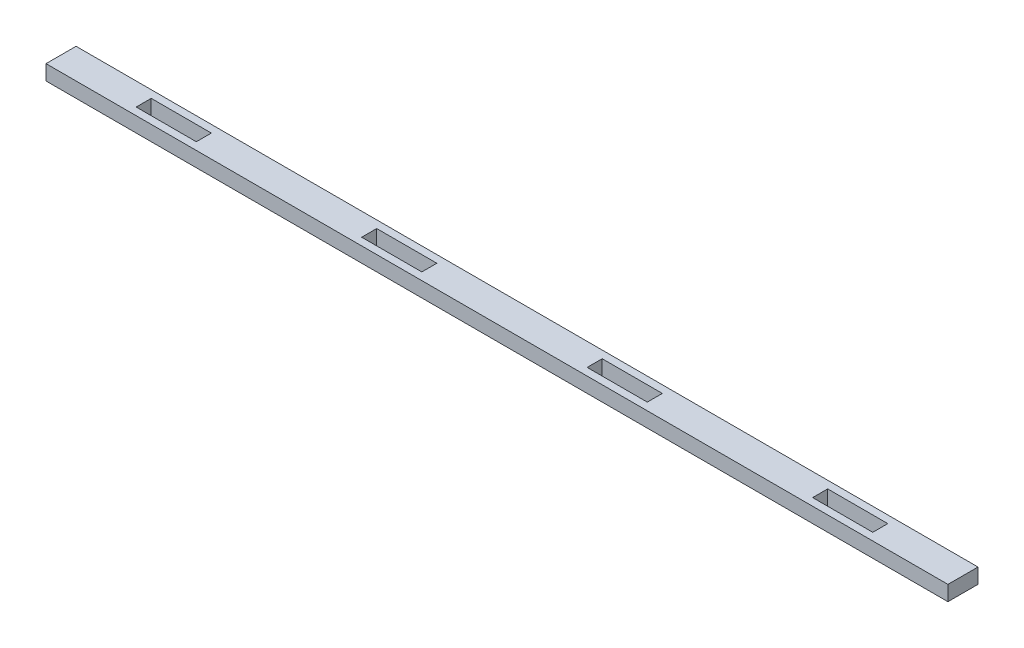
ISO-10303-21;
HEADER;
FILE_DESCRIPTION(('STEP AP214'),'2;1');
FILE_NAME('part.step','',(''),(''),'','','');
FILE_SCHEMA(('AUTOMOTIVE_DESIGN { 1 0 10303 214 1 1 1 1 }'));
ENDSEC;
DATA;
#1=APPLICATION_CONTEXT('core data for automotive mechanical design processes');
#2=APPLICATION_PROTOCOL_DEFINITION('international standard','automotive_design',2000,#1);
#3=PRODUCT_CONTEXT('',#1,'mechanical');
#4=PRODUCT('Part','Part','',(#3));
#5=PRODUCT_RELATED_PRODUCT_CATEGORY('part','',(#4));
#6=PRODUCT_DEFINITION_FORMATION('','',#4);
#7=PRODUCT_DEFINITION_CONTEXT('part definition',#1,'design');
#8=PRODUCT_DEFINITION('design','',#6,#7);
#9=PRODUCT_DEFINITION_SHAPE('','',#8);
#10=(LENGTH_UNIT() NAMED_UNIT(*) SI_UNIT(.MILLI.,.METRE.));
#11=(NAMED_UNIT(*) PLANE_ANGLE_UNIT() SI_UNIT($,.RADIAN.));
#12=(NAMED_UNIT(*) SI_UNIT($,.STERADIAN.) SOLID_ANGLE_UNIT());
#13=UNCERTAINTY_MEASURE_WITH_UNIT(LENGTH_MEASURE(1.E-05),#10,'distance_accuracy_value','');
#14=(GEOMETRIC_REPRESENTATION_CONTEXT(3) GLOBAL_UNCERTAINTY_ASSIGNED_CONTEXT((#13)) GLOBAL_UNIT_ASSIGNED_CONTEXT((#10,
#11,#12)) REPRESENTATION_CONTEXT('',''));
#15=CARTESIAN_POINT('',(0.,0.,0.));
#16=DIRECTION('',(0.,0.,1.));
#17=DIRECTION('',(1.,0.,0.));
#18=AXIS2_PLACEMENT_3D('',#15,#16,#17);
#19=CARTESIAN_POINT('',(130.175,0.,-3.17500000000001));
#20=DIRECTION('',(0.,0.,-1.));
#21=DIRECTION('',(-1.,0.,0.));
#22=AXIS2_PLACEMENT_3D('',#19,#20,#21);
#23=PLANE('',#22);
#24=DIRECTION('',(-1.,0.,0.));
#25=VECTOR('',#24,1.);
#26=CARTESIAN_POINT('',(130.175,6.35,-3.17500000000001));
#27=LINE('',#26,#25);
#28=CARTESIAN_POINT('',(155.575,6.35,-3.17499999999999));
#29=VERTEX_POINT('',#28);
#30=CARTESIAN_POINT('',(130.175,6.35,-3.17500000000001));
#31=VERTEX_POINT('',#30);
#32=EDGE_CURVE('E316',#29,#31,#27,.T.);
#33=ORIENTED_EDGE('',*,*,#32,.T.);
#34=DIRECTION('',(0.,1.,0.));
#35=VECTOR('',#34,1.);
#36=CARTESIAN_POINT('',(130.175,0.,-3.17500000000001));
#37=LINE('',#36,#35);
#38=CARTESIAN_POINT('',(130.175,0.,-3.17500000000001));
#39=VERTEX_POINT('',#38);
#40=EDGE_CURVE('E11',#39,#31,#37,.T.);
#41=ORIENTED_EDGE('',*,*,#40,.F.);
#42=DIRECTION('',(-1.,0.,0.));
#43=VECTOR('',#42,1.);
#44=CARTESIAN_POINT('',(130.175,0.,-3.17500000000001));
#45=LINE('',#44,#43);
#46=CARTESIAN_POINT('',(155.575,0.,-3.17499999999999));
#47=VERTEX_POINT('',#46);
#48=EDGE_CURVE('E320',#47,#39,#45,.T.);
#49=ORIENTED_EDGE('',*,*,#48,.F.);
#50=DIRECTION('',(0.,1.,0.));
#51=VECTOR('',#50,1.);
#52=CARTESIAN_POINT('',(155.575,0.,-3.17499999999999));
#53=LINE('',#52,#51);
#54=EDGE_CURVE('E325',#47,#29,#53,.T.);
#55=ORIENTED_EDGE('',*,*,#54,.T.);
#56=EDGE_LOOP('',(#33,#41,#49,#55));
#57=FACE_BOUND('',#56,.T.);
#58=ADVANCED_FACE('F35',(#57),#23,.F.);
#59=CARTESIAN_POINT('',(130.175,0.,-3.17500000000001));
#60=DIRECTION('',(-1.,0.,0.));
#61=DIRECTION('',(0.,0.,1.));
#62=AXIS2_PLACEMENT_3D('',#59,#60,#61);
#63=PLANE('',#62);
#64=DIRECTION('',(0.,0.,1.));
#65=VECTOR('',#64,1.);
#66=CARTESIAN_POINT('',(130.175,6.35,-3.17500000000001));
#67=LINE('',#66,#65);
#68=CARTESIAN_POINT('',(130.175,6.35,3.17500000000001));
#69=VERTEX_POINT('',#68);
#70=EDGE_CURVE('E313',#31,#69,#67,.T.);
#71=ORIENTED_EDGE('',*,*,#70,.T.);
#72=DIRECTION('',(0.,1.,0.));
#73=VECTOR('',#72,1.);
#74=CARTESIAN_POINT('',(130.175,0.,3.17500000000001));
#75=LINE('',#74,#73);
#76=CARTESIAN_POINT('',(130.175,0.,3.17500000000001));
#77=VERTEX_POINT('',#76);
#78=EDGE_CURVE('E42',#77,#69,#75,.T.);
#79=ORIENTED_EDGE('',*,*,#78,.F.);
#80=DIRECTION('',(0.,0.,1.));
#81=VECTOR('',#80,1.);
#82=CARTESIAN_POINT('',(130.175,0.,-3.17500000000001));
#83=LINE('',#82,#81);
#84=EDGE_CURVE('E56',#39,#77,#83,.T.);
#85=ORIENTED_EDGE('',*,*,#84,.F.);
#86=ORIENTED_EDGE('',*,*,#40,.T.);
#87=EDGE_LOOP('',(#71,#79,#85,#86));
#88=FACE_BOUND('',#87,.T.);
#89=ADVANCED_FACE('F335',(#88),#63,.F.);
#90=CARTESIAN_POINT('',(130.175,0.,3.17500000000001));
#91=DIRECTION('',(0.,0.,1.));
#92=DIRECTION('',(1.,0.,0.));
#93=AXIS2_PLACEMENT_3D('',#90,#91,#92);
#94=PLANE('',#93);
#95=DIRECTION('',(1.,0.,0.));
#96=VECTOR('',#95,1.);
#97=CARTESIAN_POINT('',(130.175,6.35,3.17500000000001));
#98=LINE('',#97,#96);
#99=CARTESIAN_POINT('',(155.575,6.35,3.17500000000001));
#100=VERTEX_POINT('',#99);
#101=EDGE_CURVE('E310',#69,#100,#98,.T.);
#102=ORIENTED_EDGE('',*,*,#101,.T.);
#103=DIRECTION('',(0.,1.,0.));
#104=VECTOR('',#103,1.);
#105=CARTESIAN_POINT('',(155.575,0.,3.17500000000001));
#106=LINE('',#105,#104);
#107=CARTESIAN_POINT('',(155.575,0.,3.17500000000001));
#108=VERTEX_POINT('',#107);
#109=EDGE_CURVE('E328',#108,#100,#106,.T.);
#110=ORIENTED_EDGE('',*,*,#109,.F.);
#111=DIRECTION('',(1.,0.,0.));
#112=VECTOR('',#111,1.);
#113=CARTESIAN_POINT('',(130.175,0.,3.17500000000001));
#114=LINE('',#113,#112);
#115=EDGE_CURVE('E323',#77,#108,#114,.T.);
#116=ORIENTED_EDGE('',*,*,#115,.F.);
#117=ORIENTED_EDGE('',*,*,#78,.T.);
#118=EDGE_LOOP('',(#102,#110,#116,#117));
#119=FACE_BOUND('',#118,.T.);
#120=ADVANCED_FACE('F332',(#119),#94,.F.);
#121=CARTESIAN_POINT('',(155.575,0.,-3.17499999999999));
#122=DIRECTION('',(1.,0.,0.));
#123=DIRECTION('',(0.,0.,-1.));
#124=AXIS2_PLACEMENT_3D('',#121,#122,#123);
#125=PLANE('',#124);
#126=DIRECTION('',(0.,0.,-1.));
#127=VECTOR('',#126,1.);
#128=CARTESIAN_POINT('',(155.575,6.35,-3.17499999999999));
#129=LINE('',#128,#127);
#130=EDGE_CURVE('E308',#100,#29,#129,.T.);
#131=ORIENTED_EDGE('',*,*,#130,.T.);
#132=ORIENTED_EDGE('',*,*,#54,.F.);
#133=DIRECTION('',(0.,0.,-1.));
#134=VECTOR('',#133,1.);
#135=CARTESIAN_POINT('',(155.575,0.,-3.17499999999999));
#136=LINE('',#135,#134);
#137=EDGE_CURVE('E49',#108,#47,#136,.T.);
#138=ORIENTED_EDGE('',*,*,#137,.F.);
#139=ORIENTED_EDGE('',*,*,#109,.T.);
#140=EDGE_LOOP('',(#131,#132,#138,#139));
#141=FACE_BOUND('',#140,.T.);
#142=ADVANCED_FACE('F341',(#141),#125,.F.);
#143=CARTESIAN_POINT('',(34.9250000000001,0.,-3.17500000000001));
#144=DIRECTION('',(0.,0.,-1.));
#145=DIRECTION('',(-1.,0.,0.));
#146=AXIS2_PLACEMENT_3D('',#143,#144,#145);
#147=PLANE('',#146);
#148=DIRECTION('',(-1.,0.,0.));
#149=VECTOR('',#148,1.);
#150=CARTESIAN_POINT('',(34.9250000000001,6.35,-3.17500000000001));
#151=LINE('',#150,#149);
#152=CARTESIAN_POINT('',(60.3250000000001,6.35,-3.17499999999999));
#153=VERTEX_POINT('',#152);
#154=CARTESIAN_POINT('',(34.9250000000001,6.35,-3.17500000000001));
#155=VERTEX_POINT('',#154);
#156=EDGE_CURVE('E284',#153,#155,#151,.T.);
#157=ORIENTED_EDGE('',*,*,#156,.T.);
#158=DIRECTION('',(0.,1.,0.));
#159=VECTOR('',#158,1.);
#160=CARTESIAN_POINT('',(34.9250000000001,0.,-3.17500000000001));
#161=LINE('',#160,#159);
#162=CARTESIAN_POINT('',(34.9250000000001,0.,-3.17500000000001));
#163=VERTEX_POINT('',#162);
#164=EDGE_CURVE('E305',#163,#155,#161,.T.);
#165=ORIENTED_EDGE('',*,*,#164,.F.);
#166=DIRECTION('',(-1.,0.,0.));
#167=VECTOR('',#166,1.);
#168=CARTESIAN_POINT('',(34.9250000000001,0.,-3.17500000000001));
#169=LINE('',#168,#167);
#170=CARTESIAN_POINT('',(60.3250000000001,0.,-3.17499999999999));
#171=VERTEX_POINT('',#170);
#172=EDGE_CURVE('E289',#171,#163,#169,.T.);
#173=ORIENTED_EDGE('',*,*,#172,.F.);
#174=DIRECTION('',(0.,1.,0.));
#175=VECTOR('',#174,1.);
#176=CARTESIAN_POINT('',(60.3250000000001,0.,-3.17499999999999));
#177=LINE('',#176,#175);
#178=EDGE_CURVE('E296',#171,#153,#177,.T.);
#179=ORIENTED_EDGE('',*,*,#178,.T.);
#180=EDGE_LOOP('',(#157,#165,#173,#179));
#181=FACE_BOUND('',#180,.T.);
#182=ADVANCED_FACE('F343',(#181),#147,.F.);
#183=CARTESIAN_POINT('',(34.9250000000001,0.,-3.17500000000001));
#184=DIRECTION('',(-1.,0.,0.));
#185=DIRECTION('',(0.,0.,1.));
#186=AXIS2_PLACEMENT_3D('',#183,#184,#185);
#187=PLANE('',#186);
#188=DIRECTION('',(0.,0.,1.));
#189=VECTOR('',#188,1.);
#190=CARTESIAN_POINT('',(34.9250000000001,6.35,-3.17500000000001));
#191=LINE('',#190,#189);
#192=CARTESIAN_POINT('',(34.9250000000001,6.35,3.17500000000001));
#193=VERTEX_POINT('',#192);
#194=EDGE_CURVE('E281',#155,#193,#191,.T.);
#195=ORIENTED_EDGE('',*,*,#194,.T.);
#196=DIRECTION('',(0.,1.,0.));
#197=VECTOR('',#196,1.);
#198=CARTESIAN_POINT('',(34.9250000000001,0.,3.17500000000001));
#199=LINE('',#198,#197);
#200=CARTESIAN_POINT('',(34.9250000000001,0.,3.17500000000001));
#201=VERTEX_POINT('',#200);
#202=EDGE_CURVE('E302',#201,#193,#199,.T.);
#203=ORIENTED_EDGE('',*,*,#202,.F.);
#204=DIRECTION('',(0.,0.,1.));
#205=VECTOR('',#204,1.);
#206=CARTESIAN_POINT('',(34.9250000000001,0.,-3.17500000000001));
#207=LINE('',#206,#205);
#208=EDGE_CURVE('E291',#163,#201,#207,.T.);
#209=ORIENTED_EDGE('',*,*,#208,.F.);
#210=ORIENTED_EDGE('',*,*,#164,.T.);
#211=EDGE_LOOP('',(#195,#203,#209,#210));
#212=FACE_BOUND('',#211,.T.);
#213=ADVANCED_FACE('F349',(#212),#187,.F.);
#214=CARTESIAN_POINT('',(34.9250000000001,0.,3.17500000000001));
#215=DIRECTION('',(0.,0.,1.));
#216=DIRECTION('',(1.,0.,0.));
#217=AXIS2_PLACEMENT_3D('',#214,#215,#216);
#218=PLANE('',#217);
#219=DIRECTION('',(1.,0.,0.));
#220=VECTOR('',#219,1.);
#221=CARTESIAN_POINT('',(34.9250000000001,6.35,3.17500000000001));
#222=LINE('',#221,#220);
#223=CARTESIAN_POINT('',(60.3250000000001,6.35,3.17500000000001));
#224=VERTEX_POINT('',#223);
#225=EDGE_CURVE('E278',#193,#224,#222,.T.);
#226=ORIENTED_EDGE('',*,*,#225,.T.);
#227=DIRECTION('',(0.,1.,0.));
#228=VECTOR('',#227,1.);
#229=CARTESIAN_POINT('',(60.3250000000001,0.,3.17500000000001));
#230=LINE('',#229,#228);
#231=CARTESIAN_POINT('',(60.3250000000001,0.,3.17500000000001));
#232=VERTEX_POINT('',#231);
#233=EDGE_CURVE('E299',#232,#224,#230,.T.);
#234=ORIENTED_EDGE('',*,*,#233,.F.);
#235=DIRECTION('',(1.,0.,0.));
#236=VECTOR('',#235,1.);
#237=CARTESIAN_POINT('',(34.9250000000001,0.,3.17500000000001));
#238=LINE('',#237,#236);
#239=EDGE_CURVE('E293',#201,#232,#238,.T.);
#240=ORIENTED_EDGE('',*,*,#239,.F.);
#241=ORIENTED_EDGE('',*,*,#202,.T.);
#242=EDGE_LOOP('',(#226,#234,#240,#241));
#243=FACE_BOUND('',#242,.T.);
#244=ADVANCED_FACE('F382',(#243),#218,.F.);
#245=CARTESIAN_POINT('',(60.3250000000001,0.,-3.17499999999999));
#246=DIRECTION('',(1.,0.,0.));
#247=DIRECTION('',(0.,0.,-1.));
#248=AXIS2_PLACEMENT_3D('',#245,#246,#247);
#249=PLANE('',#248);
#250=DIRECTION('',(0.,0.,-1.));
#251=VECTOR('',#250,1.);
#252=CARTESIAN_POINT('',(60.3250000000001,6.35,-3.17499999999999));
#253=LINE('',#252,#251);
#254=EDGE_CURVE('E276',#224,#153,#253,.T.);
#255=ORIENTED_EDGE('',*,*,#254,.T.);
#256=ORIENTED_EDGE('',*,*,#178,.F.);
#257=DIRECTION('',(0.,0.,-1.));
#258=VECTOR('',#257,1.);
#259=CARTESIAN_POINT('',(60.3250000000001,0.,-3.17499999999999));
#260=LINE('',#259,#258);
#261=EDGE_CURVE('E287',#232,#171,#260,.T.);
#262=ORIENTED_EDGE('',*,*,#261,.F.);
#263=ORIENTED_EDGE('',*,*,#233,.T.);
#264=EDGE_LOOP('',(#255,#256,#262,#263));
#265=FACE_BOUND('',#264,.T.);
#266=ADVANCED_FACE('F392',(#265),#249,.F.);
#267=CARTESIAN_POINT('',(190.5,6.35,-6.35));
#268=DIRECTION('',(-1.,0.,0.));
#269=DIRECTION('',(0.,0.,1.));
#270=AXIS2_PLACEMENT_3D('',#267,#268,#269);
#271=PLANE('',#270);
#272=DIRECTION('',(0.,0.,-1.));
#273=VECTOR('',#272,1.);
#274=CARTESIAN_POINT('',(190.5,0.,-6.35));
#275=LINE('',#274,#273);
#276=CARTESIAN_POINT('',(190.5,0.,6.35));
#277=VERTEX_POINT('',#276);
#278=CARTESIAN_POINT('',(190.5,0.,-6.35));
#279=VERTEX_POINT('',#278);
#280=EDGE_CURVE('E240',#277,#279,#275,.T.);
#281=ORIENTED_EDGE('',*,*,#280,.T.);
#282=DIRECTION('',(0.,-1.,0.));
#283=VECTOR('',#282,1.);
#284=CARTESIAN_POINT('',(190.5,6.35,-6.35));
#285=LINE('',#284,#283);
#286=CARTESIAN_POINT('',(190.5,6.35,-6.35));
#287=VERTEX_POINT('',#286);
#288=EDGE_CURVE('E273',#287,#279,#285,.T.);
#289=ORIENTED_EDGE('',*,*,#288,.F.);
#290=DIRECTION('',(0.,0.,-1.));
#291=VECTOR('',#290,1.);
#292=CARTESIAN_POINT('',(190.5,6.35,-6.35));
#293=LINE('',#292,#291);
#294=CARTESIAN_POINT('',(190.5,6.35,6.35));
#295=VERTEX_POINT('',#294);
#296=EDGE_CURVE('E247',#295,#287,#293,.T.);
#297=ORIENTED_EDGE('',*,*,#296,.F.);
#298=DIRECTION('',(0.,-1.,0.));
#299=VECTOR('',#298,1.);
#300=CARTESIAN_POINT('',(190.5,6.35,6.35));
#301=LINE('',#300,#299);
#302=EDGE_CURVE('E257',#295,#277,#301,.T.);
#303=ORIENTED_EDGE('',*,*,#302,.T.);
#304=EDGE_LOOP('',(#281,#289,#297,#303));
#305=FACE_BOUND('',#304,.T.);
#306=ADVANCED_FACE('F402',(#305),#271,.F.);
#307=CARTESIAN_POINT('',(-190.5,6.35,-6.35));
#308=DIRECTION('',(0.,0.,1.));
#309=DIRECTION('',(1.,0.,0.));
#310=AXIS2_PLACEMENT_3D('',#307,#308,#309);
#311=PLANE('',#310);
#312=DIRECTION('',(-1.,0.,0.));
#313=VECTOR('',#312,1.);
#314=CARTESIAN_POINT('',(-190.5,0.,-6.35));
#315=LINE('',#314,#313);
#316=CARTESIAN_POINT('',(-190.5,0.,-6.35));
#317=VERTEX_POINT('',#316);
#318=EDGE_CURVE('E260',#279,#317,#315,.T.);
#319=ORIENTED_EDGE('',*,*,#318,.T.);
#320=DIRECTION('',(0.,-1.,0.));
#321=VECTOR('',#320,1.);
#322=CARTESIAN_POINT('',(-190.5,6.35,-6.35));
#323=LINE('',#322,#321);
#324=CARTESIAN_POINT('',(-190.5,6.35,-6.35));
#325=VERTEX_POINT('',#324);
#326=EDGE_CURVE('E270',#325,#317,#323,.T.);
#327=ORIENTED_EDGE('',*,*,#326,.F.);
#328=DIRECTION('',(-1.,0.,0.));
#329=VECTOR('',#328,1.);
#330=CARTESIAN_POINT('',(-190.5,6.35,-6.35));
#331=LINE('',#330,#329);
#332=EDGE_CURVE('E250',#287,#325,#331,.T.);
#333=ORIENTED_EDGE('',*,*,#332,.F.);
#334=ORIENTED_EDGE('',*,*,#288,.T.);
#335=EDGE_LOOP('',(#319,#327,#333,#334));
#336=FACE_BOUND('',#335,.T.);
#337=ADVANCED_FACE('F488',(#336),#311,.F.);
#338=CARTESIAN_POINT('',(-190.5,6.35,-6.35));
#339=DIRECTION('',(1.,0.,0.));
#340=DIRECTION('',(0.,0.,-1.));
#341=AXIS2_PLACEMENT_3D('',#338,#339,#340);
#342=PLANE('',#341);
#343=DIRECTION('',(0.,0.,1.));
#344=VECTOR('',#343,1.);
#345=CARTESIAN_POINT('',(-190.5,0.,-6.35));
#346=LINE('',#345,#344);
#347=CARTESIAN_POINT('',(-190.5,0.,6.35));
#348=VERTEX_POINT('',#347);
#349=EDGE_CURVE('E262',#317,#348,#346,.T.);
#350=ORIENTED_EDGE('',*,*,#349,.T.);
#351=DIRECTION('',(0.,-1.,0.));
#352=VECTOR('',#351,1.);
#353=CARTESIAN_POINT('',(-190.5,6.35,6.35));
#354=LINE('',#353,#352);
#355=CARTESIAN_POINT('',(-190.5,6.35,6.35));
#356=VERTEX_POINT('',#355);
#357=EDGE_CURVE('E267',#356,#348,#354,.T.);
#358=ORIENTED_EDGE('',*,*,#357,.F.);
#359=DIRECTION('',(0.,0.,1.));
#360=VECTOR('',#359,1.);
#361=CARTESIAN_POINT('',(-190.5,6.35,-6.35));
#362=LINE('',#361,#360);
#363=EDGE_CURVE('E253',#325,#356,#362,.T.);
#364=ORIENTED_EDGE('',*,*,#363,.F.);
#365=ORIENTED_EDGE('',*,*,#326,.T.);
#366=EDGE_LOOP('',(#350,#358,#364,#365));
#367=FACE_BOUND('',#366,.T.);
#368=ADVANCED_FACE('F484',(#367),#342,.F.);
#369=CARTESIAN_POINT('',(-190.5,6.35,6.35));
#370=DIRECTION('',(0.,0.,-1.));
#371=DIRECTION('',(-1.,0.,0.));
#372=AXIS2_PLACEMENT_3D('',#369,#370,#371);
#373=PLANE('',#372);
#374=DIRECTION('',(1.,0.,0.));
#375=VECTOR('',#374,1.);
#376=CARTESIAN_POINT('',(-190.5,0.,6.35));
#377=LINE('',#376,#375);
#378=EDGE_CURVE('E251',#348,#277,#377,.T.);
#379=ORIENTED_EDGE('',*,*,#378,.T.);
#380=ORIENTED_EDGE('',*,*,#302,.F.);
#381=DIRECTION('',(1.,0.,0.));
#382=VECTOR('',#381,1.);
#383=CARTESIAN_POINT('',(-190.5,6.35,6.35));
#384=LINE('',#383,#382);
#385=EDGE_CURVE('E255',#356,#295,#384,.T.);
#386=ORIENTED_EDGE('',*,*,#385,.F.);
#387=ORIENTED_EDGE('',*,*,#357,.T.);
#388=EDGE_LOOP('',(#379,#380,#386,#387));
#389=FACE_BOUND('',#388,.T.);
#390=ADVANCED_FACE('F415',(#389),#373,.F.);
#391=CARTESIAN_POINT('',(0.,6.35,0.));
#392=DIRECTION('',(0.,1.,0.));
#393=DIRECTION('',(0.,0.,1.));
#394=AXIS2_PLACEMENT_3D('',#391,#392,#393);
#395=PLANE('',#394);
#396=DIRECTION('',(0.,0.,-1.));
#397=VECTOR('',#396,1.);
#398=CARTESIAN_POINT('',(-34.9249999999999,6.35,-3.17499999999999));
#399=LINE('',#398,#397);
#400=CARTESIAN_POINT('',(-34.9249999999999,6.35,3.17500000000001));
#401=VERTEX_POINT('',#400);
#402=CARTESIAN_POINT('',(-34.9249999999999,6.35,-3.17499999999999));
#403=VERTEX_POINT('',#402);
#404=EDGE_CURVE('E209',#401,#403,#399,.T.);
#405=ORIENTED_EDGE('',*,*,#404,.F.);
#406=DIRECTION('',(1.,0.,0.));
#407=VECTOR('',#406,1.);
#408=CARTESIAN_POINT('',(-60.3249999999999,6.35,3.17500000000001));
#409=LINE('',#408,#407);
#410=CARTESIAN_POINT('',(-60.3249999999999,6.35,3.17500000000001));
#411=VERTEX_POINT('',#410);
#412=EDGE_CURVE('E195',#411,#401,#409,.T.);
#413=ORIENTED_EDGE('',*,*,#412,.F.);
#414=DIRECTION('',(0.,0.,1.));
#415=VECTOR('',#414,1.);
#416=CARTESIAN_POINT('',(-60.3249999999999,6.35,-3.17500000000001));
#417=LINE('',#416,#415);
#418=CARTESIAN_POINT('',(-60.3249999999999,6.35,-3.17500000000001));
#419=VERTEX_POINT('',#418);
#420=EDGE_CURVE('E187',#419,#411,#417,.T.);
#421=ORIENTED_EDGE('',*,*,#420,.F.);
#422=DIRECTION('',(-1.,0.,0.));
#423=VECTOR('',#422,1.);
#424=CARTESIAN_POINT('',(-60.3249999999999,6.35,-3.17500000000001));
#425=LINE('',#424,#423);
#426=EDGE_CURVE('E173',#403,#419,#425,.T.);
#427=ORIENTED_EDGE('',*,*,#426,.F.);
#428=EDGE_LOOP('',(#405,#413,#421,#427));
#429=FACE_BOUND('',#428,.T.);
#430=DIRECTION('',(0.,0.,-1.));
#431=VECTOR('',#430,1.);
#432=CARTESIAN_POINT('',(-130.175,6.35,-3.17499999999999));
#433=LINE('',#432,#431);
#434=CARTESIAN_POINT('',(-130.175,6.35,3.17500000000001));
#435=VERTEX_POINT('',#434);
#436=CARTESIAN_POINT('',(-130.175,6.35,-3.17499999999999));
#437=VERTEX_POINT('',#436);
#438=EDGE_CURVE('E214',#435,#437,#433,.T.);
#439=ORIENTED_EDGE('',*,*,#438,.F.);
#440=DIRECTION('',(1.,0.,0.));
#441=VECTOR('',#440,1.);
#442=CARTESIAN_POINT('',(-155.575,6.35,3.17500000000001));
#443=LINE('',#442,#441);
#444=CARTESIAN_POINT('',(-155.575,6.35,3.17500000000001));
#445=VERTEX_POINT('',#444);
#446=EDGE_CURVE('E219',#445,#435,#443,.T.);
#447=ORIENTED_EDGE('',*,*,#446,.F.);
#448=DIRECTION('',(0.,0.,1.));
#449=VECTOR('',#448,1.);
#450=CARTESIAN_POINT('',(-155.575,6.35,-3.17500000000001));
#451=LINE('',#450,#449);
#452=CARTESIAN_POINT('',(-155.575,6.35,-3.17500000000001));
#453=VERTEX_POINT('',#452);
#454=EDGE_CURVE('E233',#453,#445,#451,.T.);
#455=ORIENTED_EDGE('',*,*,#454,.F.);
#456=DIRECTION('',(-1.,0.,0.));
#457=VECTOR('',#456,1.);
#458=CARTESIAN_POINT('',(-155.575,6.35,-3.17500000000001));
#459=LINE('',#458,#457);
#460=EDGE_CURVE('E230',#437,#453,#459,.T.);
#461=ORIENTED_EDGE('',*,*,#460,.F.);
#462=EDGE_LOOP('',(#439,#447,#455,#461));
#463=FACE_BOUND('',#462,.T.);
#464=ORIENTED_EDGE('',*,*,#296,.T.);
#465=ORIENTED_EDGE('',*,*,#332,.T.);
#466=ORIENTED_EDGE('',*,*,#363,.T.);
#467=ORIENTED_EDGE('',*,*,#385,.T.);
#468=EDGE_LOOP('',(#464,#465,#466,#467));
#469=FACE_BOUND('',#468,.T.);
#470=ORIENTED_EDGE('',*,*,#254,.F.);
#471=ORIENTED_EDGE('',*,*,#225,.F.);
#472=ORIENTED_EDGE('',*,*,#194,.F.);
#473=ORIENTED_EDGE('',*,*,#156,.F.);
#474=EDGE_LOOP('',(#470,#471,#472,#473));
#475=FACE_BOUND('',#474,.T.);
#476=ORIENTED_EDGE('',*,*,#130,.F.);
#477=ORIENTED_EDGE('',*,*,#101,.F.);
#478=ORIENTED_EDGE('',*,*,#70,.F.);
#479=ORIENTED_EDGE('',*,*,#32,.F.);
#480=EDGE_LOOP('',(#476,#477,#478,#479));
#481=FACE_BOUND('',#480,.T.);
#482=ADVANCED_FACE('F193',(#429,#463,#469,#475,#481),#395,.T.);
#483=CARTESIAN_POINT('',(0.,0.,0.));
#484=DIRECTION('',(0.,1.,0.));
#485=DIRECTION('',(0.,0.,1.));
#486=AXIS2_PLACEMENT_3D('',#483,#484,#485);
#487=PLANE('',#486);
#488=DIRECTION('',(1.,0.,0.));
#489=VECTOR('',#488,1.);
#490=CARTESIAN_POINT('',(-60.3249999999999,0.,3.17500000000001));
#491=LINE('',#490,#489);
#492=CARTESIAN_POINT('',(-60.3249999999999,0.,3.17500000000001));
#493=VERTEX_POINT('',#492);
#494=CARTESIAN_POINT('',(-34.9249999999999,0.,3.17500000000001));
#495=VERTEX_POINT('',#494);
#496=EDGE_CURVE('E206',#493,#495,#491,.T.);
#497=ORIENTED_EDGE('',*,*,#496,.T.);
#498=DIRECTION('',(0.,0.,-1.));
#499=VECTOR('',#498,1.);
#500=CARTESIAN_POINT('',(-34.9249999999999,0.,-3.17499999999999));
#501=LINE('',#500,#499);
#502=CARTESIAN_POINT('',(-34.9249999999999,0.,-3.17499999999999));
#503=VERTEX_POINT('',#502);
#504=EDGE_CURVE('E211',#495,#503,#501,.T.);
#505=ORIENTED_EDGE('',*,*,#504,.T.);
#506=DIRECTION('',(-1.,0.,0.));
#507=VECTOR('',#506,1.);
#508=CARTESIAN_POINT('',(-60.3249999999999,0.,-3.17500000000001));
#509=LINE('',#508,#507);
#510=CARTESIAN_POINT('',(-60.3249999999999,0.,-3.17500000000001));
#511=VERTEX_POINT('',#510);
#512=EDGE_CURVE('E183',#503,#511,#509,.T.);
#513=ORIENTED_EDGE('',*,*,#512,.T.);
#514=DIRECTION('',(0.,0.,1.));
#515=VECTOR('',#514,1.);
#516=CARTESIAN_POINT('',(-60.3249999999999,0.,-3.17500000000001));
#517=LINE('',#516,#515);
#518=EDGE_CURVE('E190',#511,#493,#517,.T.);
#519=ORIENTED_EDGE('',*,*,#518,.T.);
#520=EDGE_LOOP('',(#497,#505,#513,#519));
#521=FACE_BOUND('',#520,.T.);
#522=DIRECTION('',(1.,0.,0.));
#523=VECTOR('',#522,1.);
#524=CARTESIAN_POINT('',(-155.575,0.,3.17500000000001));
#525=LINE('',#524,#523);
#526=CARTESIAN_POINT('',(-155.575,0.,3.17500000000001));
#527=VERTEX_POINT('',#526);
#528=CARTESIAN_POINT('',(-130.175,0.,3.17500000000001));
#529=VERTEX_POINT('',#528);
#530=EDGE_CURVE('E225',#527,#529,#525,.T.);
#531=ORIENTED_EDGE('',*,*,#530,.T.);
#532=DIRECTION('',(0.,0.,-1.));
#533=VECTOR('',#532,1.);
#534=CARTESIAN_POINT('',(-130.175,0.,-3.17499999999999));
#535=LINE('',#534,#533);
#536=CARTESIAN_POINT('',(-130.175,0.,-3.17499999999999));
#537=VERTEX_POINT('',#536);
#538=EDGE_CURVE('E215',#529,#537,#535,.T.);
#539=ORIENTED_EDGE('',*,*,#538,.T.);
#540=DIRECTION('',(-1.,0.,0.));
#541=VECTOR('',#540,1.);
#542=CARTESIAN_POINT('',(-155.575,0.,-3.17500000000001));
#543=LINE('',#542,#541);
#544=CARTESIAN_POINT('',(-155.575,0.,-3.17500000000001));
#545=VERTEX_POINT('',#544);
#546=EDGE_CURVE('E218',#537,#545,#543,.T.);
#547=ORIENTED_EDGE('',*,*,#546,.T.);
#548=DIRECTION('',(0.,0.,1.));
#549=VECTOR('',#548,1.);
#550=CARTESIAN_POINT('',(-155.575,0.,-3.17500000000001));
#551=LINE('',#550,#549);
#552=EDGE_CURVE('E222',#545,#527,#551,.T.);
#553=ORIENTED_EDGE('',*,*,#552,.T.);
#554=EDGE_LOOP('',(#531,#539,#547,#553));
#555=FACE_BOUND('',#554,.T.);
#556=ORIENTED_EDGE('',*,*,#280,.F.);
#557=ORIENTED_EDGE('',*,*,#378,.F.);
#558=ORIENTED_EDGE('',*,*,#349,.F.);
#559=ORIENTED_EDGE('',*,*,#318,.F.);
#560=EDGE_LOOP('',(#556,#557,#558,#559));
#561=FACE_BOUND('',#560,.T.);
#562=ORIENTED_EDGE('',*,*,#261,.T.);
#563=ORIENTED_EDGE('',*,*,#172,.T.);
#564=ORIENTED_EDGE('',*,*,#208,.T.);
#565=ORIENTED_EDGE('',*,*,#239,.T.);
#566=EDGE_LOOP('',(#562,#563,#564,#565));
#567=FACE_BOUND('',#566,.T.);
#568=ORIENTED_EDGE('',*,*,#137,.T.);
#569=ORIENTED_EDGE('',*,*,#48,.T.);
#570=ORIENTED_EDGE('',*,*,#84,.T.);
#571=ORIENTED_EDGE('',*,*,#115,.T.);
#572=EDGE_LOOP('',(#568,#569,#570,#571));
#573=FACE_BOUND('',#572,.T.);
#574=ADVANCED_FACE('F414',(#521,#555,#561,#567,#573),#487,.F.);
#575=CARTESIAN_POINT('',(-130.175,0.,-3.17499999999999));
#576=DIRECTION('',(1.,0.,0.));
#577=DIRECTION('',(0.,0.,-1.));
#578=AXIS2_PLACEMENT_3D('',#575,#576,#577);
#579=PLANE('',#578);
#580=ORIENTED_EDGE('',*,*,#438,.T.);
#581=DIRECTION('',(0.,1.,0.));
#582=VECTOR('',#581,1.);
#583=CARTESIAN_POINT('',(-130.175,0.,-3.17499999999999));
#584=LINE('',#583,#582);
#585=EDGE_CURVE('E228',#537,#437,#584,.T.);
#586=ORIENTED_EDGE('',*,*,#585,.F.);
#587=ORIENTED_EDGE('',*,*,#538,.F.);
#588=DIRECTION('',(0.,1.,0.));
#589=VECTOR('',#588,1.);
#590=CARTESIAN_POINT('',(-130.175,0.,3.17500000000001));
#591=LINE('',#590,#589);
#592=EDGE_CURVE('E238',#529,#435,#591,.T.);
#593=ORIENTED_EDGE('',*,*,#592,.T.);
#594=EDGE_LOOP('',(#580,#586,#587,#593));
#595=FACE_BOUND('',#594,.T.);
#596=ADVANCED_FACE('F426',(#595),#579,.F.);
#597=CARTESIAN_POINT('',(-155.575,0.,3.17500000000001));
#598=DIRECTION('',(0.,0.,1.));
#599=DIRECTION('',(1.,0.,0.));
#600=AXIS2_PLACEMENT_3D('',#597,#598,#599);
#601=PLANE('',#600);
#602=ORIENTED_EDGE('',*,*,#446,.T.);
#603=ORIENTED_EDGE('',*,*,#592,.F.);
#604=ORIENTED_EDGE('',*,*,#530,.F.);
#605=DIRECTION('',(0.,1.,0.));
#606=VECTOR('',#605,1.);
#607=CARTESIAN_POINT('',(-155.575,0.,3.17500000000001));
#608=LINE('',#607,#606);
#609=EDGE_CURVE('E241',#527,#445,#608,.T.);
#610=ORIENTED_EDGE('',*,*,#609,.T.);
#611=EDGE_LOOP('',(#602,#603,#604,#610));
#612=FACE_BOUND('',#611,.T.);
#613=ADVANCED_FACE('F471',(#612),#601,.F.);
#614=CARTESIAN_POINT('',(-155.575,0.,-3.17500000000001));
#615=DIRECTION('',(-1.,0.,0.));
#616=DIRECTION('',(0.,0.,1.));
#617=AXIS2_PLACEMENT_3D('',#614,#615,#616);
#618=PLANE('',#617);
#619=ORIENTED_EDGE('',*,*,#454,.T.);
#620=ORIENTED_EDGE('',*,*,#609,.F.);
#621=ORIENTED_EDGE('',*,*,#552,.F.);
#622=DIRECTION('',(0.,1.,0.));
#623=VECTOR('',#622,1.);
#624=CARTESIAN_POINT('',(-155.575,0.,-3.17500000000001));
#625=LINE('',#624,#623);
#626=EDGE_CURVE('E243',#545,#453,#625,.T.);
#627=ORIENTED_EDGE('',*,*,#626,.T.);
#628=EDGE_LOOP('',(#619,#620,#621,#627));
#629=FACE_BOUND('',#628,.T.);
#630=ADVANCED_FACE('F474',(#629),#618,.F.);
#631=CARTESIAN_POINT('',(-155.575,0.,-3.17500000000001));
#632=DIRECTION('',(0.,0.,-1.));
#633=DIRECTION('',(-1.,0.,0.));
#634=AXIS2_PLACEMENT_3D('',#631,#632,#633);
#635=PLANE('',#634);
#636=ORIENTED_EDGE('',*,*,#460,.T.);
#637=ORIENTED_EDGE('',*,*,#626,.F.);
#638=ORIENTED_EDGE('',*,*,#546,.F.);
#639=ORIENTED_EDGE('',*,*,#585,.T.);
#640=EDGE_LOOP('',(#636,#637,#638,#639));
#641=FACE_BOUND('',#640,.T.);
#642=ADVANCED_FACE('F439',(#641),#635,.F.);
#643=CARTESIAN_POINT('',(-34.9249999999999,0.,-3.17499999999999));
#644=DIRECTION('',(1.,0.,0.));
#645=DIRECTION('',(0.,0.,-1.));
#646=AXIS2_PLACEMENT_3D('',#643,#644,#645);
#647=PLANE('',#646);
#648=ORIENTED_EDGE('',*,*,#404,.T.);
#649=DIRECTION('',(0.,1.,0.));
#650=VECTOR('',#649,1.);
#651=CARTESIAN_POINT('',(-34.9249999999999,0.,-3.17499999999999));
#652=LINE('',#651,#650);
#653=EDGE_CURVE('E179',#503,#403,#652,.T.);
#654=ORIENTED_EDGE('',*,*,#653,.F.);
#655=ORIENTED_EDGE('',*,*,#504,.F.);
#656=DIRECTION('',(0.,1.,0.));
#657=VECTOR('',#656,1.);
#658=CARTESIAN_POINT('',(-34.9249999999999,0.,3.17500000000001));
#659=LINE('',#658,#657);
#660=EDGE_CURVE('E203',#495,#401,#659,.T.);
#661=ORIENTED_EDGE('',*,*,#660,.T.);
#662=EDGE_LOOP('',(#648,#654,#655,#661));
#663=FACE_BOUND('',#662,.T.);
#664=ADVANCED_FACE('F434',(#663),#647,.F.);
#665=CARTESIAN_POINT('',(-60.3249999999999,0.,3.17500000000001));
#666=DIRECTION('',(0.,0.,1.));
#667=DIRECTION('',(1.,0.,0.));
#668=AXIS2_PLACEMENT_3D('',#665,#666,#667);
#669=PLANE('',#668);
#670=ORIENTED_EDGE('',*,*,#412,.T.);
#671=ORIENTED_EDGE('',*,*,#660,.F.);
#672=ORIENTED_EDGE('',*,*,#496,.F.);
#673=DIRECTION('',(0.,1.,0.));
#674=VECTOR('',#673,1.);
#675=CARTESIAN_POINT('',(-60.3249999999999,0.,3.17500000000001));
#676=LINE('',#675,#674);
#677=EDGE_CURVE('E196',#493,#411,#676,.T.);
#678=ORIENTED_EDGE('',*,*,#677,.T.);
#679=EDGE_LOOP('',(#670,#671,#672,#678));
#680=FACE_BOUND('',#679,.T.);
#681=ADVANCED_FACE('F438',(#680),#669,.F.);
#682=CARTESIAN_POINT('',(-60.3249999999999,0.,-3.17500000000001));
#683=DIRECTION('',(-1.,0.,0.));
#684=DIRECTION('',(0.,0.,1.));
#685=AXIS2_PLACEMENT_3D('',#682,#683,#684);
#686=PLANE('',#685);
#687=ORIENTED_EDGE('',*,*,#420,.T.);
#688=ORIENTED_EDGE('',*,*,#677,.F.);
#689=ORIENTED_EDGE('',*,*,#518,.F.);
#690=DIRECTION('',(0.,1.,0.));
#691=VECTOR('',#690,1.);
#692=CARTESIAN_POINT('',(-60.3249999999999,0.,-3.17500000000001));
#693=LINE('',#692,#691);
#694=EDGE_CURVE('E176',#511,#419,#693,.T.);
#695=ORIENTED_EDGE('',*,*,#694,.T.);
#696=EDGE_LOOP('',(#687,#688,#689,#695));
#697=FACE_BOUND('',#696,.T.);
#698=ADVANCED_FACE('F186',(#697),#686,.F.);
#699=CARTESIAN_POINT('',(-60.3249999999999,0.,-3.17500000000001));
#700=DIRECTION('',(0.,0.,-1.));
#701=DIRECTION('',(-1.,0.,0.));
#702=AXIS2_PLACEMENT_3D('',#699,#700,#701);
#703=PLANE('',#702);
#704=ORIENTED_EDGE('',*,*,#426,.T.);
#705=ORIENTED_EDGE('',*,*,#694,.F.);
#706=ORIENTED_EDGE('',*,*,#512,.F.);
#707=ORIENTED_EDGE('',*,*,#653,.T.);
#708=EDGE_LOOP('',(#704,#705,#706,#707));
#709=FACE_BOUND('',#708,.T.);
#710=ADVANCED_FACE('F175',(#709),#703,.F.);
#711=CLOSED_SHELL('',(#58,#89,#120,#142,#182,#213,#244,#266,#306,#337,#368,#390,#482,#574,#596,
#613,#630,#642,#664,#681,#698,#710));
#712=MANIFOLD_SOLID_BREP('B2',#711);
#713=ADVANCED_BREP_SHAPE_REPRESENTATION('',(#18,#712),#14);
#714=SHAPE_DEFINITION_REPRESENTATION(#9,#713);
ENDSEC;
END-ISO-10303-21;
